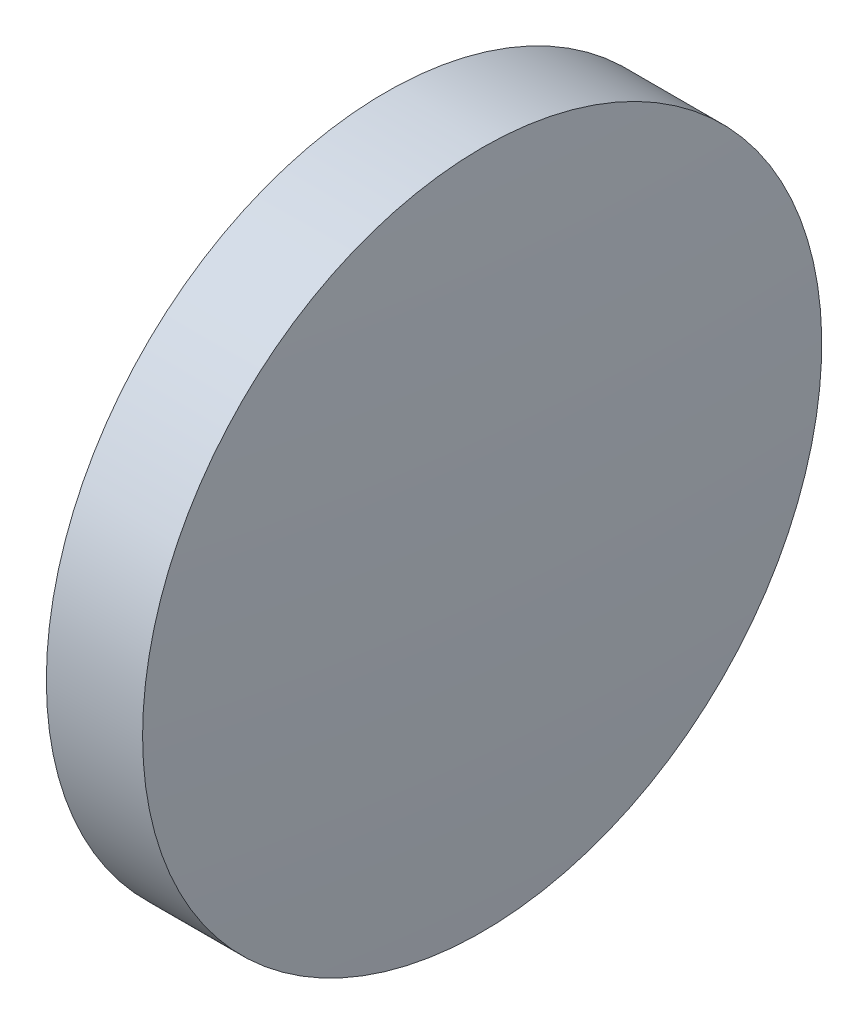
ISO-10303-21;
HEADER;
FILE_DESCRIPTION(('STEP AP214'),'2;1');
FILE_NAME('part.step','',(''),(''),'','','');
FILE_SCHEMA(('AUTOMOTIVE_DESIGN { 1 0 10303 214 1 1 1 1 }'));
ENDSEC;
DATA;
#1=APPLICATION_CONTEXT('core data for automotive mechanical design processes');
#2=APPLICATION_PROTOCOL_DEFINITION('international standard','automotive_design',2000,#1);
#3=PRODUCT_CONTEXT('',#1,'mechanical');
#4=PRODUCT('Part','Part','',(#3));
#5=PRODUCT_RELATED_PRODUCT_CATEGORY('part','',(#4));
#6=PRODUCT_DEFINITION_FORMATION('','',#4);
#7=PRODUCT_DEFINITION_CONTEXT('part definition',#1,'design');
#8=PRODUCT_DEFINITION('design','',#6,#7);
#9=PRODUCT_DEFINITION_SHAPE('','',#8);
#10=(LENGTH_UNIT() NAMED_UNIT(*) SI_UNIT(.MILLI.,.METRE.));
#11=(NAMED_UNIT(*) PLANE_ANGLE_UNIT() SI_UNIT($,.RADIAN.));
#12=(NAMED_UNIT(*) SI_UNIT($,.STERADIAN.) SOLID_ANGLE_UNIT());
#13=UNCERTAINTY_MEASURE_WITH_UNIT(LENGTH_MEASURE(1.E-05),#10,'distance_accuracy_value','');
#14=(GEOMETRIC_REPRESENTATION_CONTEXT(3) GLOBAL_UNCERTAINTY_ASSIGNED_CONTEXT((#13)) GLOBAL_UNIT_ASSIGNED_CONTEXT((#10,
#11,#12)) REPRESENTATION_CONTEXT('',''));
#15=CARTESIAN_POINT('',(0.,0.,0.));
#16=DIRECTION('',(0.,0.,1.));
#17=DIRECTION('',(1.,0.,0.));
#18=AXIS2_PLACEMENT_3D('',#15,#16,#17);
#19=CARTESIAN_POINT('',(150.25602386772,151.839578728031,0.));
#20=DIRECTION('',(-1.,0.,0.));
#21=DIRECTION('',(0.,1.,0.));
#22=AXIS2_PLACEMENT_3D('',#19,#20,#21);
#23=SPHERICAL_SURFACE('',#22,201.812499999997);
#24=CARTESIAN_POINT('',(351.668523867718,151.839578728031,0.));
#25=DIRECTION('',(-1.,0.,0.));
#26=DIRECTION('',(0.,0.,1.));
#27=AXIS2_PLACEMENT_3D('',#24,#25,#26);
#28=CIRCLE('',#27,12.7);
#29=CARTESIAN_POINT('',(351.668523867718,151.839578728031,12.7));
#30=VERTEX_POINT('',#29);
#31=EDGE_CURVE('E10',#30,#30,#28,.T.);
#32=ORIENTED_EDGE('',*,*,#31,.F.);
#33=EDGE_LOOP('',(#32));
#34=FACE_BOUND('',#33,.T.);
#35=ADVANCED_FACE('F35',(#34),#23,.T.);
#36=CARTESIAN_POINT('',(342.330305832041,151.839578728031,0.));
#37=DIRECTION('',(-1.,0.,0.));
#38=DIRECTION('',(0.,0.,1.));
#39=AXIS2_PLACEMENT_3D('',#36,#37,#38);
#40=CYLINDRICAL_SURFACE('',#39,12.7);
#41=CARTESIAN_POINT('',(348.068523867718,151.839578728031,0.));
#42=DIRECTION('',(-1.,0.,0.));
#43=DIRECTION('',(0.,0.,1.));
#44=AXIS2_PLACEMENT_3D('',#41,#42,#43);
#45=CIRCLE('',#44,12.7);
#46=CARTESIAN_POINT('',(348.068523867718,151.839578728031,12.7));
#47=VERTEX_POINT('',#46);
#48=EDGE_CURVE('E41',#47,#47,#45,.T.);
#49=ORIENTED_EDGE('',*,*,#48,.F.);
#50=EDGE_LOOP('',(#49));
#51=FACE_BOUND('',#50,.T.);
#52=ORIENTED_EDGE('',*,*,#31,.T.);
#53=EDGE_LOOP('',(#52));
#54=FACE_BOUND('',#53,.T.);
#55=ADVANCED_FACE('F49',(#51,#54),#40,.T.);
#56=CARTESIAN_POINT('',(348.068523867718,151.839578728031,0.));
#57=DIRECTION('',(1.,0.,0.));
#58=DIRECTION('',(0.,0.,-1.));
#59=AXIS2_PLACEMENT_3D('',#56,#57,#58);
#60=PLANE('',#59);
#61=ORIENTED_EDGE('',*,*,#48,.T.);
#62=EDGE_LOOP('',(#61));
#63=FACE_BOUND('',#62,.T.);
#64=ADVANCED_FACE('F47',(#63),#60,.F.);
#65=CLOSED_SHELL('',(#35,#55,#64));
#66=MANIFOLD_SOLID_BREP('B2',#65);
#67=ADVANCED_BREP_SHAPE_REPRESENTATION('',(#18,#66),#14);
#68=SHAPE_DEFINITION_REPRESENTATION(#9,#67);
ENDSEC;
END-ISO-10303-21;
